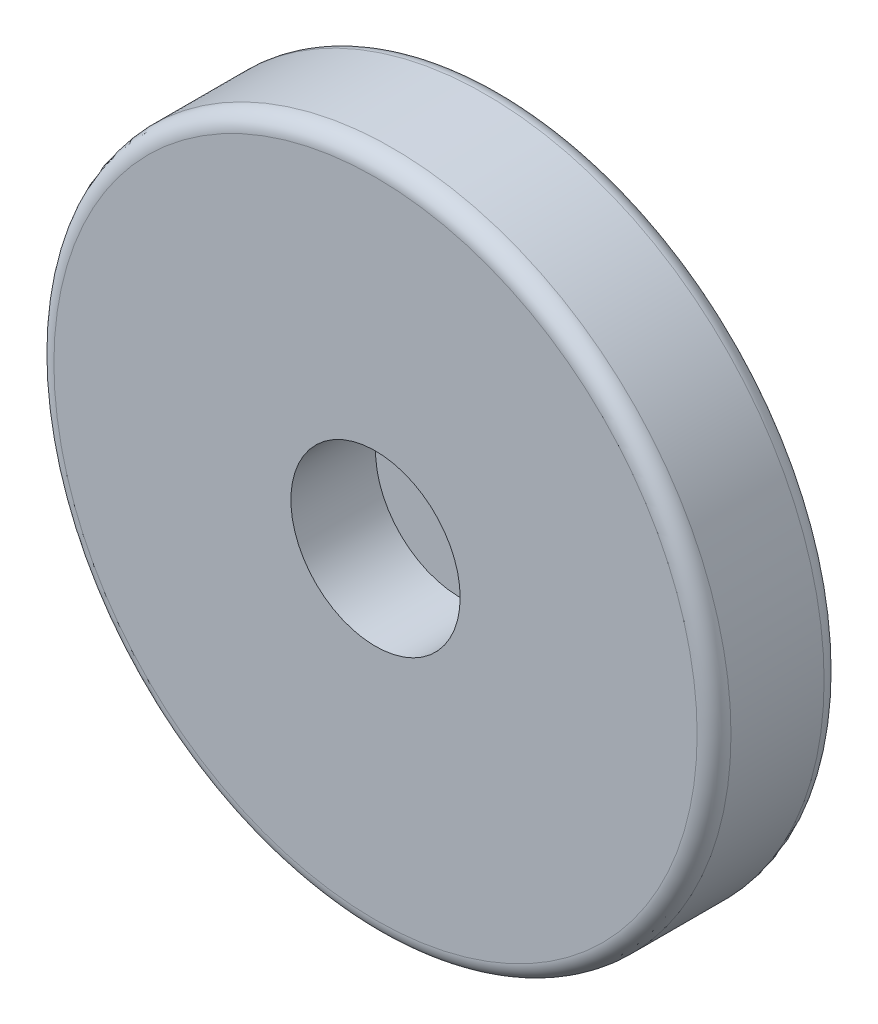
ISO-10303-21;
HEADER;
FILE_DESCRIPTION(('STEP AP214'),'2;1');
FILE_NAME('part.step','',(''),(''),'','','');
FILE_SCHEMA(('AUTOMOTIVE_DESIGN { 1 0 10303 214 1 1 1 1 }'));
ENDSEC;
DATA;
#1=APPLICATION_CONTEXT('core data for automotive mechanical design processes');
#2=APPLICATION_PROTOCOL_DEFINITION('international standard','automotive_design',2000,#1);
#3=PRODUCT_CONTEXT('',#1,'mechanical');
#4=PRODUCT('Part','Part','',(#3));
#5=PRODUCT_RELATED_PRODUCT_CATEGORY('part','',(#4));
#6=PRODUCT_DEFINITION_FORMATION('','',#4);
#7=PRODUCT_DEFINITION_CONTEXT('part definition',#1,'design');
#8=PRODUCT_DEFINITION('design','',#6,#7);
#9=PRODUCT_DEFINITION_SHAPE('','',#8);
#10=(LENGTH_UNIT() NAMED_UNIT(*) SI_UNIT(.MILLI.,.METRE.));
#11=(NAMED_UNIT(*) PLANE_ANGLE_UNIT() SI_UNIT($,.RADIAN.));
#12=(NAMED_UNIT(*) SI_UNIT($,.STERADIAN.) SOLID_ANGLE_UNIT());
#13=UNCERTAINTY_MEASURE_WITH_UNIT(LENGTH_MEASURE(1.E-05),#10,'distance_accuracy_value','');
#14=(GEOMETRIC_REPRESENTATION_CONTEXT(3) GLOBAL_UNCERTAINTY_ASSIGNED_CONTEXT((#13)) GLOBAL_UNIT_ASSIGNED_CONTEXT((#10,
#11,#12)) REPRESENTATION_CONTEXT('',''));
#15=CARTESIAN_POINT('',(0.,0.,0.));
#16=DIRECTION('',(0.,0.,1.));
#17=DIRECTION('',(1.,0.,0.));
#18=AXIS2_PLACEMENT_3D('',#15,#16,#17);
#19=CARTESIAN_POINT('',(0.,0.,19.05));
#20=DIRECTION('',(0.,0.,-1.));
#21=DIRECTION('',(-1.,0.,0.));
#22=AXIS2_PLACEMENT_3D('',#19,#20,#21);
#23=CYLINDRICAL_SURFACE('',#22,101.6);
#24=CARTESIAN_POINT('',(0.,0.,-13.97));
#25=DIRECTION('',(0.,0.,1.));
#26=DIRECTION('',(1.,0.,0.));
#27=AXIS2_PLACEMENT_3D('',#24,#25,#26);
#28=CIRCLE('',#27,101.6);
#29=CARTESIAN_POINT('',(101.6,0.,-13.97));
#30=VERTEX_POINT('',#29);
#31=EDGE_CURVE('E44',#30,#30,#28,.T.);
#32=ORIENTED_EDGE('',*,*,#31,.T.);
#33=EDGE_LOOP('',(#32));
#34=FACE_BOUND('',#33,.T.);
#35=CARTESIAN_POINT('',(0.,0.,13.97));
#36=DIRECTION('',(0.,0.,1.));
#37=DIRECTION('',(1.,0.,0.));
#38=AXIS2_PLACEMENT_3D('',#35,#36,#37);
#39=CIRCLE('',#38,101.6);
#40=CARTESIAN_POINT('',(101.6,0.,13.97));
#41=VERTEX_POINT('',#40);
#42=EDGE_CURVE('E48',#41,#41,#39,.F.);
#43=ORIENTED_EDGE('',*,*,#42,.T.);
#44=EDGE_LOOP('',(#43));
#45=FACE_BOUND('',#44,.T.);
#46=ADVANCED_FACE('F33',(#34,#45),#23,.T.);
#47=CARTESIAN_POINT('',(0.,0.,19.05));
#48=DIRECTION('',(0.,0.,1.));
#49=DIRECTION('',(1.,0.,0.));
#50=AXIS2_PLACEMENT_3D('',#47,#48,#49);
#51=PLANE('',#50);
#52=CARTESIAN_POINT('',(0.,0.,19.05));
#53=DIRECTION('',(0.,0.,1.));
#54=DIRECTION('',(1.,0.,0.));
#55=AXIS2_PLACEMENT_3D('',#52,#53,#54);
#56=CIRCLE('',#55,25.4);
#57=CARTESIAN_POINT('',(25.4,0.,19.05));
#58=VERTEX_POINT('',#57);
#59=EDGE_CURVE('E54',#58,#58,#56,.T.);
#60=ORIENTED_EDGE('',*,*,#59,.F.);
#61=EDGE_LOOP('',(#60));
#62=FACE_BOUND('',#61,.T.);
#63=CARTESIAN_POINT('',(0.,0.,19.05));
#64=DIRECTION('',(0.,0.,1.));
#65=DIRECTION('',(1.,0.,0.));
#66=AXIS2_PLACEMENT_3D('',#63,#64,#65);
#67=CIRCLE('',#66,96.52);
#68=CARTESIAN_POINT('',(96.52,0.,19.05));
#69=VERTEX_POINT('',#68);
#70=EDGE_CURVE('E10',#69,#69,#67,.T.);
#71=ORIENTED_EDGE('',*,*,#70,.T.);
#72=EDGE_LOOP('',(#71));
#73=FACE_BOUND('',#72,.T.);
#74=ADVANCED_FACE('F68',(#62,#73),#51,.T.);
#75=CARTESIAN_POINT('',(0.,0.,-19.05));
#76=DIRECTION('',(0.,0.,1.));
#77=DIRECTION('',(1.,0.,0.));
#78=AXIS2_PLACEMENT_3D('',#75,#76,#77);
#79=PLANE('',#78);
#80=CARTESIAN_POINT('',(0.,0.,-19.05));
#81=DIRECTION('',(0.,0.,1.));
#82=DIRECTION('',(1.,0.,0.));
#83=AXIS2_PLACEMENT_3D('',#80,#81,#82);
#84=CIRCLE('',#83,96.52);
#85=CARTESIAN_POINT('',(96.52,0.,-19.05));
#86=VERTEX_POINT('',#85);
#87=EDGE_CURVE('E40',#86,#86,#84,.F.);
#88=ORIENTED_EDGE('',*,*,#87,.T.);
#89=EDGE_LOOP('',(#88));
#90=FACE_BOUND('',#89,.T.);
#91=ADVANCED_FACE('F70',(#90),#79,.F.);
#92=CARTESIAN_POINT('',(0.,0.,-13.97));
#93=DIRECTION('',(0.,0.,1.));
#94=DIRECTION('',(1.,0.,0.));
#95=AXIS2_PLACEMENT_3D('',#92,#93,#94);
#96=TOROIDAL_SURFACE('',#95,96.52,5.08);
#97=ORIENTED_EDGE('',*,*,#87,.F.);
#98=EDGE_LOOP('',(#97));
#99=FACE_BOUND('',#98,.T.);
#100=ORIENTED_EDGE('',*,*,#31,.F.);
#101=EDGE_LOOP('',(#100));
#102=FACE_BOUND('',#101,.T.);
#103=ADVANCED_FACE('F76',(#99,#102),#96,.T.);
#104=CARTESIAN_POINT('',(0.,0.,13.97));
#105=DIRECTION('',(0.,0.,1.));
#106=DIRECTION('',(1.,0.,0.));
#107=AXIS2_PLACEMENT_3D('',#104,#105,#106);
#108=TOROIDAL_SURFACE('',#107,96.52,5.08);
#109=ORIENTED_EDGE('',*,*,#42,.F.);
#110=EDGE_LOOP('',(#109));
#111=FACE_BOUND('',#110,.T.);
#112=ORIENTED_EDGE('',*,*,#70,.F.);
#113=EDGE_LOOP('',(#112));
#114=FACE_BOUND('',#113,.T.);
#115=ADVANCED_FACE('F35',(#111,#114),#108,.T.);
#116=CARTESIAN_POINT('',(0.,0.,-6.35));
#117=DIRECTION('',(0.,0.,1.));
#118=DIRECTION('',(1.,0.,0.));
#119=AXIS2_PLACEMENT_3D('',#116,#117,#118);
#120=CYLINDRICAL_SURFACE('',#119,25.4);
#121=CARTESIAN_POINT('',(0.,0.,-6.35));
#122=DIRECTION('',(0.,0.,1.));
#123=DIRECTION('',(1.,0.,0.));
#124=AXIS2_PLACEMENT_3D('',#121,#122,#123);
#125=CIRCLE('',#124,25.4);
#126=CARTESIAN_POINT('',(25.4,0.,-6.35));
#127=VERTEX_POINT('',#126);
#128=EDGE_CURVE('E53',#127,#127,#125,.T.);
#129=ORIENTED_EDGE('',*,*,#128,.F.);
#130=EDGE_LOOP('',(#129));
#131=FACE_BOUND('',#130,.T.);
#132=ORIENTED_EDGE('',*,*,#59,.T.);
#133=EDGE_LOOP('',(#132));
#134=FACE_BOUND('',#133,.T.);
#135=ADVANCED_FACE('F62',(#131,#134),#120,.F.);
#136=CARTESIAN_POINT('',(0.,0.,-6.35));
#137=DIRECTION('',(0.,0.,1.));
#138=DIRECTION('',(1.,0.,0.));
#139=AXIS2_PLACEMENT_3D('',#136,#137,#138);
#140=PLANE('',#139);
#141=ORIENTED_EDGE('',*,*,#128,.T.);
#142=EDGE_LOOP('',(#141));
#143=FACE_BOUND('',#142,.T.);
#144=ADVANCED_FACE('F60',(#143),#140,.T.);
#145=CLOSED_SHELL('',(#46,#74,#91,#103,#115,#135,#144));
#146=MANIFOLD_SOLID_BREP('B2',#145);
#147=ADVANCED_BREP_SHAPE_REPRESENTATION('',(#18,#146),#14);
#148=SHAPE_DEFINITION_REPRESENTATION(#9,#147);
ENDSEC;
END-ISO-10303-21;
